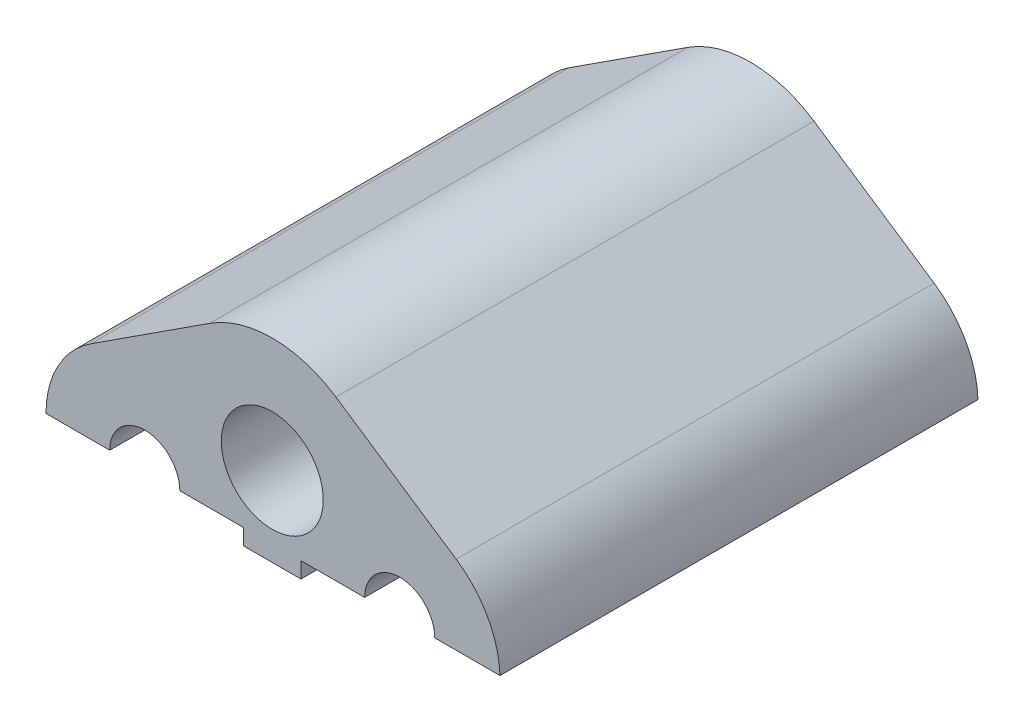
ISO-10303-21;
HEADER;
FILE_DESCRIPTION(('STEP AP214'),'2;1');
FILE_NAME('part.step','',(''),(''),'','','');
FILE_SCHEMA(('AUTOMOTIVE_DESIGN { 1 0 10303 214 1 1 1 1 }'));
ENDSEC;
DATA;
#1=APPLICATION_CONTEXT('core data for automotive mechanical design processes');
#2=APPLICATION_PROTOCOL_DEFINITION('international standard','automotive_design',2000,#1);
#3=PRODUCT_CONTEXT('',#1,'mechanical');
#4=PRODUCT('Part','Part','',(#3));
#5=PRODUCT_RELATED_PRODUCT_CATEGORY('part','',(#4));
#6=PRODUCT_DEFINITION_FORMATION('','',#4);
#7=PRODUCT_DEFINITION_CONTEXT('part definition',#1,'design');
#8=PRODUCT_DEFINITION('design','',#6,#7);
#9=PRODUCT_DEFINITION_SHAPE('','',#8);
#10=(LENGTH_UNIT() NAMED_UNIT(*) SI_UNIT(.MILLI.,.METRE.));
#11=(NAMED_UNIT(*) PLANE_ANGLE_UNIT() SI_UNIT($,.RADIAN.));
#12=(NAMED_UNIT(*) SI_UNIT($,.STERADIAN.) SOLID_ANGLE_UNIT());
#13=UNCERTAINTY_MEASURE_WITH_UNIT(LENGTH_MEASURE(1.E-05),#10,'distance_accuracy_value','');
#14=(GEOMETRIC_REPRESENTATION_CONTEXT(3) GLOBAL_UNCERTAINTY_ASSIGNED_CONTEXT((#13)) GLOBAL_UNIT_ASSIGNED_CONTEXT((#10,
#11,#12)) REPRESENTATION_CONTEXT('',''));
#15=CARTESIAN_POINT('',(0.,0.,0.));
#16=DIRECTION('',(0.,0.,1.));
#17=DIRECTION('',(1.,0.,0.));
#18=AXIS2_PLACEMENT_3D('',#15,#16,#17);
#19=CARTESIAN_POINT('',(0.,0.,0.));
#20=DIRECTION('',(0.,-1.,0.));
#21=DIRECTION('',(0.,0.,-1.));
#22=AXIS2_PLACEMENT_3D('',#19,#20,#21);
#23=PLANE('',#22);
#24=DIRECTION('',(0.,0.,1.));
#25=VECTOR('',#24,1.);
#26=CARTESIAN_POINT('',(1.24744302503624,0.,-1.86815416922694));
#27=LINE('',#26,#25);
#28=CARTESIAN_POINT('',(1.24744302503624,0.,0.));
#29=VERTEX_POINT('',#28);
#30=CARTESIAN_POINT('',(1.24744302503624,0.,15.));
#31=VERTEX_POINT('',#30);
#32=EDGE_CURVE('E169',#29,#31,#27,.T.);
#33=ORIENTED_EDGE('',*,*,#32,.F.);
#34=DIRECTION('',(1.,0.,0.));
#35=VECTOR('',#34,1.);
#36=CARTESIAN_POINT('',(0.,0.,0.));
#37=LINE('',#36,#35);
#38=CARTESIAN_POINT('',(3.24744302503624,0.,0.));
#39=VERTEX_POINT('',#38);
#40=EDGE_CURVE('E178',#29,#39,#37,.T.);
#41=ORIENTED_EDGE('',*,*,#40,.T.);
#42=DIRECTION('',(0.,0.,1.));
#43=VECTOR('',#42,1.);
#44=CARTESIAN_POINT('',(3.24744302503624,0.,0.));
#45=LINE('',#44,#43);
#46=CARTESIAN_POINT('',(3.24744302503624,0.,15.));
#47=VERTEX_POINT('',#46);
#48=EDGE_CURVE('E195',#39,#47,#45,.T.);
#49=ORIENTED_EDGE('',*,*,#48,.T.);
#50=DIRECTION('',(1.,0.,0.));
#51=VECTOR('',#50,1.);
#52=CARTESIAN_POINT('',(0.,0.,15.));
#53=LINE('',#52,#51);
#54=EDGE_CURVE('E62',#31,#47,#53,.T.);
#55=ORIENTED_EDGE('',*,*,#54,.F.);
#56=EDGE_LOOP('',(#33,#41,#49,#55));
#57=FACE_BOUND('',#56,.T.);
#58=ADVANCED_FACE('F39',(#57),#23,.T.);
#59=CARTESIAN_POINT('',(4.39599344569605,-0.101847309155721,15.));
#60=DIRECTION('',(0.,0.,-1.));
#61=DIRECTION('',(-1.,0.,0.));
#62=AXIS2_PLACEMENT_3D('',#59,#60,#61);
#63=CYLINDRICAL_SURFACE('',#62,3.1);
#64=DIRECTION('',(0.,0.,-1.));
#65=VECTOR('',#64,1.);
#66=CARTESIAN_POINT('',(7.49431994973299,0.,15.));
#67=LINE('',#66,#65);
#68=CARTESIAN_POINT('',(7.49431994973299,0.,0.));
#69=VERTEX_POINT('',#68);
#70=CARTESIAN_POINT('',(7.49431994973299,0.,15.));
#71=VERTEX_POINT('',#70);
#72=EDGE_CURVE('E191',#69,#71,#67,.F.);
#73=ORIENTED_EDGE('',*,*,#72,.F.);
#74=CARTESIAN_POINT('',(4.39599344569605,-0.101847309155721,0.));
#75=DIRECTION('',(0.,0.,1.));
#76=DIRECTION('',(1.,0.,0.));
#77=AXIS2_PLACEMENT_3D('',#74,#75,#76);
#78=CIRCLE('',#77,3.1);
#79=CARTESIAN_POINT('',(6.11733332317417,2.47632821361297,0.));
#80=VERTEX_POINT('',#79);
#81=EDGE_CURVE('E203',#69,#80,#78,.T.);
#82=ORIENTED_EDGE('',*,*,#81,.T.);
#83=DIRECTION('',(0.,0.,-1.));
#84=VECTOR('',#83,1.);
#85=CARTESIAN_POINT('',(6.11733332317417,2.47632821361297,15.));
#86=LINE('',#85,#84);
#87=CARTESIAN_POINT('',(6.11733332317417,2.47632821361297,15.));
#88=VERTEX_POINT('',#87);
#89=EDGE_CURVE('E11',#88,#80,#86,.T.);
#90=ORIENTED_EDGE('',*,*,#89,.F.);
#91=CARTESIAN_POINT('',(4.39599344569605,-0.101847309155721,15.));
#92=DIRECTION('',(0.,0.,1.));
#93=DIRECTION('',(1.,0.,0.));
#94=AXIS2_PLACEMENT_3D('',#91,#92,#93);
#95=CIRCLE('',#94,3.1);
#96=EDGE_CURVE('E204',#71,#88,#95,.T.);
#97=ORIENTED_EDGE('',*,*,#96,.F.);
#98=EDGE_LOOP('',(#73,#82,#90,#97));
#99=FACE_BOUND('',#98,.T.);
#100=ADVANCED_FACE('F41',(#99),#63,.T.);
#101=CARTESIAN_POINT('',(4.34744302503624,0.,15.));
#102=DIRECTION('',(0.,0.,-1.));
#103=DIRECTION('',(-1.,0.,0.));
#104=AXIS2_PLACEMENT_3D('',#101,#102,#103);
#105=CYLINDRICAL_SURFACE('',#104,1.1);
#106=CARTESIAN_POINT('',(4.34744302503624,0.,15.));
#107=DIRECTION('',(0.,0.,1.));
#108=DIRECTION('',(1.,0.,0.));
#109=AXIS2_PLACEMENT_3D('',#106,#107,#108);
#110=CIRCLE('',#109,1.1);
#111=CARTESIAN_POINT('',(5.44744302503624,0.,15.));
#112=VERTEX_POINT('',#111);
#113=EDGE_CURVE('E220',#112,#47,#110,.T.);
#114=ORIENTED_EDGE('',*,*,#113,.T.);
#115=ORIENTED_EDGE('',*,*,#48,.F.);
#116=CARTESIAN_POINT('',(4.34744302503624,0.,0.));
#117=DIRECTION('',(0.,0.,1.));
#118=DIRECTION('',(1.,0.,0.));
#119=AXIS2_PLACEMENT_3D('',#116,#117,#118);
#120=CIRCLE('',#119,1.1);
#121=CARTESIAN_POINT('',(5.44744302503624,0.,0.));
#122=VERTEX_POINT('',#121);
#123=EDGE_CURVE('E241',#122,#39,#120,.T.);
#124=ORIENTED_EDGE('',*,*,#123,.F.);
#125=DIRECTION('',(0.,0.,1.));
#126=VECTOR('',#125,1.);
#127=CARTESIAN_POINT('',(5.44744302503624,0.,0.));
#128=LINE('',#127,#126);
#129=EDGE_CURVE('E183',#122,#112,#128,.T.);
#130=ORIENTED_EDGE('',*,*,#129,.T.);
#131=EDGE_LOOP('',(#114,#115,#124,#130));
#132=FACE_BOUND('',#131,.T.);
#133=ADVANCED_FACE('F274',(#132),#105,.F.);
#134=CARTESIAN_POINT('',(3.02970480807145,4.53780852903278,15.));
#135=DIRECTION('',(0.555270928218747,0.831669523473772,0.));
#136=DIRECTION('',(-0.831669523473772,0.555270928218747,0.));
#137=AXIS2_PLACEMENT_3D('',#134,#135,#136);
#138=PLANE('',#137);
#139=DIRECTION('',(0.831669523473772,-0.555270928218747,0.));
#140=VECTOR('',#139,1.);
#141=CARTESIAN_POINT('',(3.02970480807145,4.53780852903278,0.));
#142=LINE('',#141,#140);
#143=CARTESIAN_POINT('',(2.34641836662373,4.99401028450558,0.));
#144=VERTEX_POINT('',#143);
#145=EDGE_CURVE('E228',#144,#80,#142,.T.);
#146=ORIENTED_EDGE('',*,*,#145,.F.);
#147=DIRECTION('',(0.,0.,-1.));
#148=VECTOR('',#147,1.);
#149=CARTESIAN_POINT('',(2.34641836662373,4.99401028450558,15.));
#150=LINE('',#149,#148);
#151=CARTESIAN_POINT('',(2.34641836662373,4.99401028450558,15.));
#152=VERTEX_POINT('',#151);
#153=EDGE_CURVE('E47',#152,#144,#150,.T.);
#154=ORIENTED_EDGE('',*,*,#153,.F.);
#155=DIRECTION('',(0.831669523473772,-0.555270928218747,0.));
#156=VECTOR('',#155,1.);
#157=CARTESIAN_POINT('',(3.02970480807145,4.53780852903278,15.));
#158=LINE('',#157,#156);
#159=EDGE_CURVE('E206',#152,#88,#158,.T.);
#160=ORIENTED_EDGE('',*,*,#159,.T.);
#161=ORIENTED_EDGE('',*,*,#89,.T.);
#162=EDGE_LOOP('',(#146,#154,#160,#161));
#163=FACE_BOUND('',#162,.T.);
#164=ADVANCED_FACE('F264',(#163),#138,.T.);
#165=CARTESIAN_POINT('',(0.347443025036244,2.,15.));
#166=DIRECTION('',(0.,0.,-1.));
#167=DIRECTION('',(-1.,0.,0.));
#168=AXIS2_PLACEMENT_3D('',#165,#166,#167);
#169=CYLINDRICAL_SURFACE('',#168,3.6);
#170=CARTESIAN_POINT('',(0.347443025036244,2.,0.));
#171=DIRECTION('',(0.,0.,1.));
#172=DIRECTION('',(1.,0.,0.));
#173=AXIS2_PLACEMENT_3D('',#170,#171,#172);
#174=CIRCLE('',#173,3.6);
#175=CARTESIAN_POINT('',(-1.61243197008056,5.01974999023361,0.));
#176=VERTEX_POINT('',#175);
#177=EDGE_CURVE('E231',#144,#176,#174,.T.);
#178=ORIENTED_EDGE('',*,*,#177,.T.);
#179=DIRECTION('',(0.,0.,-1.));
#180=VECTOR('',#179,1.);
#181=CARTESIAN_POINT('',(-1.61243197008056,5.01974999023361,15.));
#182=LINE('',#181,#180);
#183=CARTESIAN_POINT('',(-1.61243197008056,5.01974999023361,15.));
#184=VERTEX_POINT('',#183);
#185=EDGE_CURVE('E248',#184,#176,#182,.T.);
#186=ORIENTED_EDGE('',*,*,#185,.F.);
#187=CARTESIAN_POINT('',(0.347443025036244,2.,15.));
#188=DIRECTION('',(0.,0.,1.));
#189=DIRECTION('',(1.,0.,0.));
#190=AXIS2_PLACEMENT_3D('',#187,#188,#189);
#191=CIRCLE('',#190,3.6);
#192=EDGE_CURVE('E210',#152,#184,#191,.T.);
#193=ORIENTED_EDGE('',*,*,#192,.F.);
#194=ORIENTED_EDGE('',*,*,#153,.T.);
#195=EDGE_LOOP('',(#178,#186,#193,#194));
#196=FACE_BOUND('',#195,.T.);
#197=ADVANCED_FACE('F253',(#196),#169,.T.);
#198=CARTESIAN_POINT('',(-2.77022207212689,4.2683222634572,15.));
#199=DIRECTION('',(0.544409720865779,-0.838819441731559,0.));
#200=DIRECTION('',(0.838819441731559,0.544409720865779,0.));
#201=AXIS2_PLACEMENT_3D('',#198,#199,#200);
#202=PLANE('',#201);
#203=DIRECTION('',(-0.838819441731559,-0.544409720865779,0.));
#204=VECTOR('',#203,1.);
#205=CARTESIAN_POINT('',(-2.77022207212689,4.2683222634572,0.));
#206=LINE('',#205,#204);
#207=CARTESIAN_POINT('',(-5.34022710964767,2.60034026936783,0.));
#208=VERTEX_POINT('',#207);
#209=EDGE_CURVE('E233',#176,#208,#206,.T.);
#210=ORIENTED_EDGE('',*,*,#209,.T.);
#211=DIRECTION('',(0.,0.,-1.));
#212=VECTOR('',#211,1.);
#213=CARTESIAN_POINT('',(-5.34022710964767,2.60034026936783,15.));
#214=LINE('',#213,#212);
#215=CARTESIAN_POINT('',(-5.34022710964767,2.60034026936783,15.));
#216=VERTEX_POINT('',#215);
#217=EDGE_CURVE('E226',#216,#208,#214,.T.);
#218=ORIENTED_EDGE('',*,*,#217,.F.);
#219=DIRECTION('',(-0.838819441731559,-0.544409720865779,0.));
#220=VECTOR('',#219,1.);
#221=CARTESIAN_POINT('',(-2.77022207212689,4.2683222634572,15.));
#222=LINE('',#221,#220);
#223=EDGE_CURVE('E212',#184,#216,#222,.T.);
#224=ORIENTED_EDGE('',*,*,#223,.F.);
#225=ORIENTED_EDGE('',*,*,#185,.T.);
#226=EDGE_LOOP('',(#210,#218,#224,#225));
#227=FACE_BOUND('',#226,.T.);
#228=ADVANCED_FACE('F296',(#227),#202,.F.);
#229=CARTESIAN_POINT('',(-3.65255697496376,0.,15.));
#230=DIRECTION('',(0.,0.,-1.));
#231=DIRECTION('',(-1.,0.,0.));
#232=AXIS2_PLACEMENT_3D('',#229,#230,#231);
#233=CYLINDRICAL_SURFACE('',#232,1.1);
#234=DIRECTION('',(0.,0.,1.));
#235=VECTOR('',#234,1.);
#236=CARTESIAN_POINT('',(-4.75255697496376,0.,0.));
#237=LINE('',#236,#235);
#238=CARTESIAN_POINT('',(-4.75255697496376,0.,0.));
#239=VERTEX_POINT('',#238);
#240=CARTESIAN_POINT('',(-4.75255697496376,0.,15.));
#241=VERTEX_POINT('',#240);
#242=EDGE_CURVE('E189',#239,#241,#237,.T.);
#243=ORIENTED_EDGE('',*,*,#242,.F.);
#244=CARTESIAN_POINT('',(-3.65255697496376,0.,0.));
#245=DIRECTION('',(0.,0.,1.));
#246=DIRECTION('',(1.,0.,0.));
#247=AXIS2_PLACEMENT_3D('',#244,#245,#246);
#248=CIRCLE('',#247,1.1);
#249=CARTESIAN_POINT('',(-2.55255697496376,0.,0.));
#250=VERTEX_POINT('',#249);
#251=EDGE_CURVE('E238',#250,#239,#248,.T.);
#252=ORIENTED_EDGE('',*,*,#251,.F.);
#253=DIRECTION('',(0.,0.,1.));
#254=VECTOR('',#253,1.);
#255=CARTESIAN_POINT('',(-2.55255697496376,0.,0.));
#256=LINE('',#255,#254);
#257=CARTESIAN_POINT('',(-2.55255697496376,0.,15.));
#258=VERTEX_POINT('',#257);
#259=EDGE_CURVE('E192',#250,#258,#256,.T.);
#260=ORIENTED_EDGE('',*,*,#259,.T.);
#261=CARTESIAN_POINT('',(-3.65255697496376,0.,15.));
#262=DIRECTION('',(0.,0.,1.));
#263=DIRECTION('',(1.,0.,0.));
#264=AXIS2_PLACEMENT_3D('',#261,#262,#263);
#265=CIRCLE('',#264,1.1);
#266=EDGE_CURVE('E217',#258,#241,#265,.T.);
#267=ORIENTED_EDGE('',*,*,#266,.T.);
#268=EDGE_LOOP('',(#243,#252,#260,#267));
#269=FACE_BOUND('',#268,.T.);
#270=ADVANCED_FACE('F287',(#269),#233,.F.);
#271=CARTESIAN_POINT('',(-3.65255697496376,0.,15.));
#272=DIRECTION('',(0.,0.,-1.));
#273=DIRECTION('',(-1.,0.,0.));
#274=AXIS2_PLACEMENT_3D('',#271,#272,#273);
#275=CYLINDRICAL_SURFACE('',#274,3.1);
#276=CARTESIAN_POINT('',(-3.65255697496376,0.,0.));
#277=DIRECTION('',(0.,0.,1.));
#278=DIRECTION('',(1.,0.,0.));
#279=AXIS2_PLACEMENT_3D('',#276,#277,#278);
#280=CIRCLE('',#279,3.1);
#281=CARTESIAN_POINT('',(-6.75255697496376,0.,0.));
#282=VERTEX_POINT('',#281);
#283=EDGE_CURVE('E235',#208,#282,#280,.T.);
#284=ORIENTED_EDGE('',*,*,#283,.T.);
#285=DIRECTION('',(0.,0.,-1.));
#286=VECTOR('',#285,1.);
#287=CARTESIAN_POINT('',(-6.75255697496376,0.,15.));
#288=LINE('',#287,#286);
#289=CARTESIAN_POINT('',(-6.75255697496376,0.,15.));
#290=VERTEX_POINT('',#289);
#291=EDGE_CURVE('E200',#282,#290,#288,.F.);
#292=ORIENTED_EDGE('',*,*,#291,.T.);
#293=CARTESIAN_POINT('',(-3.65255697496376,0.,15.));
#294=DIRECTION('',(0.,0.,1.));
#295=DIRECTION('',(1.,0.,0.));
#296=AXIS2_PLACEMENT_3D('',#293,#294,#295);
#297=CIRCLE('',#296,3.1);
#298=EDGE_CURVE('E214',#216,#290,#297,.T.);
#299=ORIENTED_EDGE('',*,*,#298,.F.);
#300=ORIENTED_EDGE('',*,*,#217,.T.);
#301=EDGE_LOOP('',(#284,#292,#299,#300));
#302=FACE_BOUND('',#301,.T.);
#303=ADVANCED_FACE('F292',(#302),#275,.T.);
#304=CARTESIAN_POINT('',(0.347443025036244,2.,15.));
#305=DIRECTION('',(0.,0.,-1.));
#306=DIRECTION('',(-1.,0.,0.));
#307=AXIS2_PLACEMENT_3D('',#304,#305,#306);
#308=CYLINDRICAL_SURFACE('',#307,1.6);
#309=CARTESIAN_POINT('',(0.347443025036244,2.,15.));
#310=DIRECTION('',(0.,0.,1.));
#311=DIRECTION('',(1.,0.,0.));
#312=AXIS2_PLACEMENT_3D('',#309,#310,#311);
#313=CIRCLE('',#312,1.6);
#314=CARTESIAN_POINT('',(1.94744302503624,2.,15.));
#315=VERTEX_POINT('',#314);
#316=EDGE_CURVE('E223',#315,#315,#313,.T.);
#317=ORIENTED_EDGE('',*,*,#316,.T.);
#318=EDGE_LOOP('',(#317));
#319=FACE_BOUND('',#318,.T.);
#320=CARTESIAN_POINT('',(0.347443025036244,2.,0.));
#321=DIRECTION('',(0.,0.,1.));
#322=DIRECTION('',(1.,0.,0.));
#323=AXIS2_PLACEMENT_3D('',#320,#321,#322);
#324=CIRCLE('',#323,1.6);
#325=CARTESIAN_POINT('',(1.94744302503624,2.,0.));
#326=VERTEX_POINT('',#325);
#327=EDGE_CURVE('E207',#326,#326,#324,.T.);
#328=ORIENTED_EDGE('',*,*,#327,.F.);
#329=EDGE_LOOP('',(#328));
#330=FACE_BOUND('',#329,.T.);
#331=ADVANCED_FACE('F326',(#319,#330),#308,.F.);
#332=CARTESIAN_POINT('',(0.,0.,15.));
#333=DIRECTION('',(0.,0.,1.));
#334=DIRECTION('',(1.,0.,0.));
#335=AXIS2_PLACEMENT_3D('',#332,#333,#334);
#336=PLANE('',#335);
#337=DIRECTION('',(-1.,0.,0.));
#338=VECTOR('',#337,1.);
#339=CARTESIAN_POINT('',(0.,0.,15.));
#340=LINE('',#339,#338);
#341=EDGE_CURVE('E179',#241,#290,#340,.T.);
#342=ORIENTED_EDGE('',*,*,#341,.F.);
#343=ORIENTED_EDGE('',*,*,#266,.F.);
#344=CARTESIAN_POINT('',(-0.552556974963756,0.,15.));
#345=VERTEX_POINT('',#344);
#346=EDGE_CURVE('E163',#258,#345,#53,.T.);
#347=ORIENTED_EDGE('',*,*,#346,.T.);
#348=DIRECTION('',(0.,-1.,0.));
#349=VECTOR('',#348,1.);
#350=CARTESIAN_POINT('',(-0.552556974963756,-0.5,15.));
#351=LINE('',#350,#349);
#352=CARTESIAN_POINT('',(-0.552556974963756,-0.5,15.));
#353=VERTEX_POINT('',#352);
#354=EDGE_CURVE('E146',#345,#353,#351,.T.);
#355=ORIENTED_EDGE('',*,*,#354,.T.);
#356=DIRECTION('',(1.,0.,0.));
#357=VECTOR('',#356,1.);
#358=CARTESIAN_POINT('',(-0.552556974963756,-0.5,15.));
#359=LINE('',#358,#357);
#360=CARTESIAN_POINT('',(1.24744302503624,-0.5,15.));
#361=VERTEX_POINT('',#360);
#362=EDGE_CURVE('E161',#353,#361,#359,.T.);
#363=ORIENTED_EDGE('',*,*,#362,.T.);
#364=DIRECTION('',(0.,1.,0.));
#365=VECTOR('',#364,1.);
#366=CARTESIAN_POINT('',(1.24744302503624,-0.5,15.));
#367=LINE('',#366,#365);
#368=EDGE_CURVE('E164',#361,#31,#367,.T.);
#369=ORIENTED_EDGE('',*,*,#368,.T.);
#370=ORIENTED_EDGE('',*,*,#54,.T.);
#371=ORIENTED_EDGE('',*,*,#113,.F.);
#372=EDGE_CURVE('E184',#112,#71,#53,.T.);
#373=ORIENTED_EDGE('',*,*,#372,.T.);
#374=ORIENTED_EDGE('',*,*,#96,.T.);
#375=ORIENTED_EDGE('',*,*,#159,.F.);
#376=ORIENTED_EDGE('',*,*,#192,.T.);
#377=ORIENTED_EDGE('',*,*,#223,.T.);
#378=ORIENTED_EDGE('',*,*,#298,.T.);
#379=EDGE_LOOP('',(#342,#343,#347,#355,#363,#369,#370,#371,#373,#374,#375,#376,#377,#378));
#380=FACE_BOUND('',#379,.T.);
#381=ORIENTED_EDGE('',*,*,#316,.F.);
#382=EDGE_LOOP('',(#381));
#383=FACE_BOUND('',#382,.T.);
#384=ADVANCED_FACE('F158',(#380,#383),#336,.T.);
#385=CARTESIAN_POINT('',(0.,0.,0.));
#386=DIRECTION('',(0.,0.,1.));
#387=DIRECTION('',(1.,0.,0.));
#388=AXIS2_PLACEMENT_3D('',#385,#386,#387);
#389=PLANE('',#388);
#390=ORIENTED_EDGE('',*,*,#251,.T.);
#391=DIRECTION('',(-1.,0.,0.));
#392=VECTOR('',#391,1.);
#393=CARTESIAN_POINT('',(0.,0.,0.));
#394=LINE('',#393,#392);
#395=EDGE_CURVE('E180',#239,#282,#394,.T.);
#396=ORIENTED_EDGE('',*,*,#395,.T.);
#397=ORIENTED_EDGE('',*,*,#283,.F.);
#398=ORIENTED_EDGE('',*,*,#209,.F.);
#399=ORIENTED_EDGE('',*,*,#177,.F.);
#400=ORIENTED_EDGE('',*,*,#145,.T.);
#401=ORIENTED_EDGE('',*,*,#81,.F.);
#402=EDGE_CURVE('E176',#122,#69,#37,.T.);
#403=ORIENTED_EDGE('',*,*,#402,.F.);
#404=ORIENTED_EDGE('',*,*,#123,.T.);
#405=ORIENTED_EDGE('',*,*,#40,.F.);
#406=DIRECTION('',(0.,-1.,0.));
#407=VECTOR('',#406,1.);
#408=CARTESIAN_POINT('',(1.24744302503624,-0.5,0.));
#409=LINE('',#408,#407);
#410=CARTESIAN_POINT('',(1.24744302503624,-0.5,0.));
#411=VERTEX_POINT('',#410);
#412=EDGE_CURVE('E187',#29,#411,#409,.T.);
#413=ORIENTED_EDGE('',*,*,#412,.T.);
#414=DIRECTION('',(-1.,0.,0.));
#415=VECTOR('',#414,1.);
#416=CARTESIAN_POINT('',(-0.552556974963756,-0.5,0.));
#417=LINE('',#416,#415);
#418=CARTESIAN_POINT('',(-0.552556974963756,-0.5,0.));
#419=VERTEX_POINT('',#418);
#420=EDGE_CURVE('E277',#411,#419,#417,.T.);
#421=ORIENTED_EDGE('',*,*,#420,.T.);
#422=DIRECTION('',(0.,1.,0.));
#423=VECTOR('',#422,1.);
#424=CARTESIAN_POINT('',(-0.552556974963756,-0.5,0.));
#425=LINE('',#424,#423);
#426=CARTESIAN_POINT('',(-0.552556974963756,0.,0.));
#427=VERTEX_POINT('',#426);
#428=EDGE_CURVE('E147',#419,#427,#425,.T.);
#429=ORIENTED_EDGE('',*,*,#428,.T.);
#430=EDGE_CURVE('E54',#250,#427,#37,.T.);
#431=ORIENTED_EDGE('',*,*,#430,.F.);
#432=EDGE_LOOP('',(#390,#396,#397,#398,#399,#400,#401,#403,#404,#405,#413,#421,#429,#431));
#433=FACE_BOUND('',#432,.T.);
#434=ORIENTED_EDGE('',*,*,#327,.T.);
#435=EDGE_LOOP('',(#434));
#436=FACE_BOUND('',#435,.T.);
#437=ADVANCED_FACE('F260',(#433,#436),#389,.F.);
#438=ORIENTED_EDGE('',*,*,#72,.T.);
#439=ORIENTED_EDGE('',*,*,#372,.F.);
#440=ORIENTED_EDGE('',*,*,#129,.F.);
#441=ORIENTED_EDGE('',*,*,#402,.T.);
#442=EDGE_LOOP('',(#438,#439,#440,#441));
#443=FACE_BOUND('',#442,.T.);
#444=ADVANCED_FACE('F297',(#443),#23,.T.);
#445=DIRECTION('',(0.,0.,1.));
#446=VECTOR('',#445,1.);
#447=CARTESIAN_POINT('',(-0.552556974963756,0.,-1.86815416922694));
#448=LINE('',#447,#446);
#449=EDGE_CURVE('E152',#427,#345,#448,.T.);
#450=ORIENTED_EDGE('',*,*,#449,.T.);
#451=ORIENTED_EDGE('',*,*,#346,.F.);
#452=ORIENTED_EDGE('',*,*,#259,.F.);
#453=ORIENTED_EDGE('',*,*,#430,.T.);
#454=EDGE_LOOP('',(#450,#451,#452,#453));
#455=FACE_BOUND('',#454,.T.);
#456=ADVANCED_FACE('F284',(#455),#23,.T.);
#457=CARTESIAN_POINT('',(0.,0.,0.));
#458=DIRECTION('',(0.,1.,0.));
#459=DIRECTION('',(0.,0.,1.));
#460=AXIS2_PLACEMENT_3D('',#457,#458,#459);
#461=PLANE('',#460);
#462=ORIENTED_EDGE('',*,*,#395,.F.);
#463=ORIENTED_EDGE('',*,*,#242,.T.);
#464=ORIENTED_EDGE('',*,*,#341,.T.);
#465=ORIENTED_EDGE('',*,*,#291,.F.);
#466=EDGE_LOOP('',(#462,#463,#464,#465));
#467=FACE_BOUND('',#466,.T.);
#468=ADVANCED_FACE('F290',(#467),#461,.F.);
#469=CARTESIAN_POINT('',(1.24744302503624,-0.5,-1.86815416922694));
#470=DIRECTION('',(1.,0.,0.));
#471=DIRECTION('',(0.,0.,-1.));
#472=AXIS2_PLACEMENT_3D('',#469,#470,#471);
#473=PLANE('',#472);
#474=ORIENTED_EDGE('',*,*,#412,.F.);
#475=ORIENTED_EDGE('',*,*,#32,.T.);
#476=ORIENTED_EDGE('',*,*,#368,.F.);
#477=DIRECTION('',(0.,0.,1.));
#478=VECTOR('',#477,1.);
#479=CARTESIAN_POINT('',(1.24744302503624,-0.5,-1.86815416922694));
#480=LINE('',#479,#478);
#481=EDGE_CURVE('E151',#411,#361,#480,.T.);
#482=ORIENTED_EDGE('',*,*,#481,.F.);
#483=EDGE_LOOP('',(#474,#475,#476,#482));
#484=FACE_BOUND('',#483,.T.);
#485=ADVANCED_FACE('F281',(#484),#473,.T.);
#486=CARTESIAN_POINT('',(-0.552556974963756,-0.5,-1.86815416922694));
#487=DIRECTION('',(0.,-1.,0.));
#488=DIRECTION('',(0.,0.,-1.));
#489=AXIS2_PLACEMENT_3D('',#486,#487,#488);
#490=PLANE('',#489);
#491=ORIENTED_EDGE('',*,*,#420,.F.);
#492=ORIENTED_EDGE('',*,*,#481,.T.);
#493=ORIENTED_EDGE('',*,*,#362,.F.);
#494=DIRECTION('',(0.,0.,1.));
#495=VECTOR('',#494,1.);
#496=CARTESIAN_POINT('',(-0.552556974963756,-0.5,-1.86815416922694));
#497=LINE('',#496,#495);
#498=EDGE_CURVE('E142',#419,#353,#497,.T.);
#499=ORIENTED_EDGE('',*,*,#498,.F.);
#500=EDGE_LOOP('',(#491,#492,#493,#499));
#501=FACE_BOUND('',#500,.T.);
#502=ADVANCED_FACE('F166',(#501),#490,.T.);
#503=CARTESIAN_POINT('',(-0.552556974963756,-0.5,-1.86815416922694));
#504=DIRECTION('',(-1.,0.,0.));
#505=DIRECTION('',(0.,0.,1.));
#506=AXIS2_PLACEMENT_3D('',#503,#504,#505);
#507=PLANE('',#506);
#508=ORIENTED_EDGE('',*,*,#428,.F.);
#509=ORIENTED_EDGE('',*,*,#498,.T.);
#510=ORIENTED_EDGE('',*,*,#354,.F.);
#511=ORIENTED_EDGE('',*,*,#449,.F.);
#512=EDGE_LOOP('',(#508,#509,#510,#511));
#513=FACE_BOUND('',#512,.T.);
#514=ADVANCED_FACE('F144',(#513),#507,.T.);
#515=CLOSED_SHELL('',(#58,#100,#133,#164,#197,#228,#270,#303,#331,#384,#437,#444,#456,#468,#485,
#502,#514));
#516=MANIFOLD_SOLID_BREP('B2',#515);
#517=ADVANCED_BREP_SHAPE_REPRESENTATION('',(#18,#516),#14);
#518=SHAPE_DEFINITION_REPRESENTATION(#9,#517);
ENDSEC;
END-ISO-10303-21;
